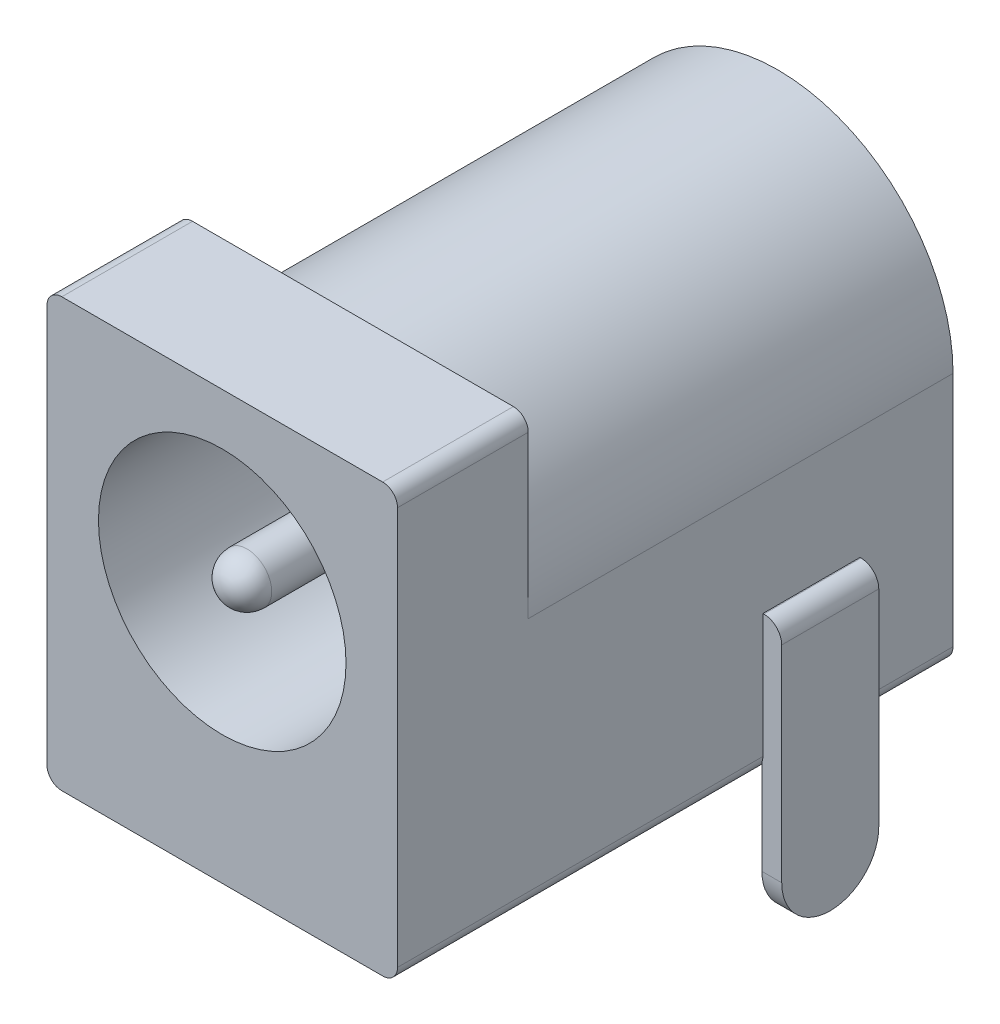
ISO-10303-21;
HEADER;
FILE_DESCRIPTION(('STEP AP214'),'2;1');
FILE_NAME('part.step','',(''),(''),'','','');
FILE_SCHEMA(('AUTOMOTIVE_DESIGN { 1 0 10303 214 1 1 1 1 }'));
ENDSEC;
DATA;
#1=APPLICATION_CONTEXT('core data for automotive mechanical design processes');
#2=APPLICATION_PROTOCOL_DEFINITION('international standard','automotive_design',2000,#1);
#3=PRODUCT_CONTEXT('',#1,'mechanical');
#4=PRODUCT('Part','Part','',(#3));
#5=PRODUCT_RELATED_PRODUCT_CATEGORY('part','',(#4));
#6=PRODUCT_DEFINITION_FORMATION('','',#4);
#7=PRODUCT_DEFINITION_CONTEXT('part definition',#1,'design');
#8=PRODUCT_DEFINITION('design','',#6,#7);
#9=PRODUCT_DEFINITION_SHAPE('','',#8);
#10=(LENGTH_UNIT() NAMED_UNIT(*) SI_UNIT(.MILLI.,.METRE.));
#11=(NAMED_UNIT(*) PLANE_ANGLE_UNIT() SI_UNIT($,.RADIAN.));
#12=(NAMED_UNIT(*) SI_UNIT($,.STERADIAN.) SOLID_ANGLE_UNIT());
#13=UNCERTAINTY_MEASURE_WITH_UNIT(LENGTH_MEASURE(1.E-05),#10,'distance_accuracy_value','');
#14=(GEOMETRIC_REPRESENTATION_CONTEXT(3) GLOBAL_UNCERTAINTY_ASSIGNED_CONTEXT((#13)) GLOBAL_UNIT_ASSIGNED_CONTEXT((#10,
#11,#12)) REPRESENTATION_CONTEXT('',''));
#15=CARTESIAN_POINT('',(0.,0.,0.));
#16=DIRECTION('',(0.,0.,1.));
#17=DIRECTION('',(1.,0.,0.));
#18=AXIS2_PLACEMENT_3D('',#15,#16,#17);
#19=CARTESIAN_POINT('',(8.9662,-3.683,2.3876));
#20=DIRECTION('',(-1.,0.,0.));
#21=DIRECTION('',(0.,0.,1.));
#22=AXIS2_PLACEMENT_3D('',#19,#20,#21);
#23=PLANE('',#22);
#24=DIRECTION('',(0.,1.,0.));
#25=VECTOR('',#24,1.);
#26=CARTESIAN_POINT('',(8.9662,-3.683,2.3876));
#27=LINE('',#26,#25);
#28=CARTESIAN_POINT('',(8.96619999999999,-2.1844,2.3876));
#29=VERTEX_POINT('',#28);
#30=CARTESIAN_POINT('',(8.9662,0.244216813898783,2.3876));
#31=VERTEX_POINT('',#30);
#32=EDGE_CURVE('E227',#29,#31,#27,.T.);
#33=ORIENTED_EDGE('',*,*,#32,.F.);
#34=CARTESIAN_POINT('',(8.96619999999999,-2.1844,3.6322));
#35=DIRECTION('',(1.,0.,0.));
#36=DIRECTION('',(0.,0.,-1.));
#37=AXIS2_PLACEMENT_3D('',#34,#35,#36);
#38=CIRCLE('',#37,1.2446);
#39=CARTESIAN_POINT('',(8.96619999999999,-2.1844,4.8768));
#40=VERTEX_POINT('',#39);
#41=EDGE_CURVE('E214',#40,#29,#38,.T.);
#42=ORIENTED_EDGE('',*,*,#41,.F.);
#43=DIRECTION('',(0.,1.,0.));
#44=VECTOR('',#43,1.);
#45=CARTESIAN_POINT('',(8.9662,-3.683,4.8768));
#46=LINE('',#45,#44);
#47=CARTESIAN_POINT('',(8.9662,0.244216813898783,4.8768));
#48=VERTEX_POINT('',#47);
#49=EDGE_CURVE('E247',#40,#48,#46,.T.);
#50=ORIENTED_EDGE('',*,*,#49,.T.);
#51=DIRECTION('',(0.,0.,-1.));
#52=VECTOR('',#51,1.);
#53=CARTESIAN_POINT('',(8.9662,0.244216813898783,14.2494));
#54=LINE('',#53,#52);
#55=EDGE_CURVE('E234',#31,#48,#54,.F.);
#56=ORIENTED_EDGE('',*,*,#55,.F.);
#57=EDGE_LOOP('',(#33,#42,#50,#56));
#58=FACE_BOUND('',#57,.T.);
#59=ADVANCED_FACE('F38',(#58),#23,.T.);
#60=CARTESIAN_POINT('',(8.9662,-3.683,2.3876));
#61=DIRECTION('',(0.,0.,1.));
#62=DIRECTION('',(1.,0.,0.));
#63=AXIS2_PLACEMENT_3D('',#60,#61,#62);
#64=PLANE('',#63);
#65=DIRECTION('',(1.,0.,0.));
#66=VECTOR('',#65,1.);
#67=CARTESIAN_POINT('',(8.96619999999999,-2.1844,2.3876));
#68=LINE('',#67,#66);
#69=CARTESIAN_POINT('',(9.47419999999999,-2.1844,2.3876));
#70=VERTEX_POINT('',#69);
#71=EDGE_CURVE('E53',#29,#70,#68,.T.);
#72=ORIENTED_EDGE('',*,*,#71,.F.);
#73=ORIENTED_EDGE('',*,*,#32,.T.);
#74=CARTESIAN_POINT('',(8.6106,0.380999999999999,2.3876));
#75=DIRECTION('',(0.,0.,1.));
#76=DIRECTION('',(1.,0.,0.));
#77=AXIS2_PLACEMENT_3D('',#74,#75,#76);
#78=CIRCLE('',#77,0.380999999999999);
#79=CARTESIAN_POINT('',(8.99159999999999,0.380999999999999,2.3876));
#80=VERTEX_POINT('',#79);
#81=EDGE_CURVE('E238',#31,#80,#78,.T.);
#82=ORIENTED_EDGE('',*,*,#81,.T.);
#83=DIRECTION('',(0.,-1.,0.));
#84=VECTOR('',#83,1.);
#85=CARTESIAN_POINT('',(8.9916,10.5918,2.3876));
#86=LINE('',#85,#84);
#87=CARTESIAN_POINT('',(8.9916,3.556,2.3876));
#88=VERTEX_POINT('',#87);
#89=EDGE_CURVE('E345',#88,#80,#86,.T.);
#90=ORIENTED_EDGE('',*,*,#89,.F.);
#91=DIRECTION('',(1.,0.,0.));
#92=VECTOR('',#91,1.);
#93=CARTESIAN_POINT('',(8.9662,3.556,2.3876));
#94=LINE('',#93,#92);
#95=CARTESIAN_POINT('',(9.017,3.556,2.3876));
#96=VERTEX_POINT('',#95);
#97=EDGE_CURVE('E243',#88,#96,#94,.T.);
#98=ORIENTED_EDGE('',*,*,#97,.T.);
#99=CARTESIAN_POINT('',(9.017,3.0988,2.3876));
#100=DIRECTION('',(0.,0.,1.));
#101=DIRECTION('',(1.,0.,0.));
#102=AXIS2_PLACEMENT_3D('',#99,#100,#101);
#103=CIRCLE('',#102,0.4572);
#104=CARTESIAN_POINT('',(9.47419999999999,3.0988,2.3876));
#105=VERTEX_POINT('',#104);
#106=EDGE_CURVE('E381',#96,#105,#103,.F.);
#107=ORIENTED_EDGE('',*,*,#106,.T.);
#108=DIRECTION('',(0.,1.,0.));
#109=VECTOR('',#108,1.);
#110=CARTESIAN_POINT('',(9.47419999999999,-3.683,2.3876));
#111=LINE('',#110,#109);
#112=EDGE_CURVE('E230',#70,#105,#111,.T.);
#113=ORIENTED_EDGE('',*,*,#112,.F.);
#114=EDGE_LOOP('',(#72,#73,#82,#90,#98,#107,#113));
#115=FACE_BOUND('',#114,.T.);
#116=ADVANCED_FACE('F225',(#115),#64,.F.);
#117=CARTESIAN_POINT('',(9.47419999999999,-3.683,4.8768));
#118=DIRECTION('',(1.,0.,0.));
#119=DIRECTION('',(0.,0.,-1.));
#120=AXIS2_PLACEMENT_3D('',#117,#118,#119);
#121=PLANE('',#120);
#122=DIRECTION('',(0.,1.,0.));
#123=VECTOR('',#122,1.);
#124=CARTESIAN_POINT('',(9.47419999999999,-3.683,4.8768));
#125=LINE('',#124,#123);
#126=CARTESIAN_POINT('',(9.47419999999999,-2.1844,4.8768));
#127=VERTEX_POINT('',#126);
#128=CARTESIAN_POINT('',(9.47419999999999,3.0988,4.8768));
#129=VERTEX_POINT('',#128);
#130=EDGE_CURVE('E240',#127,#129,#125,.T.);
#131=ORIENTED_EDGE('',*,*,#130,.F.);
#132=CARTESIAN_POINT('',(9.47419999999999,-2.1844,3.6322));
#133=DIRECTION('',(1.,0.,0.));
#134=DIRECTION('',(0.,0.,-1.));
#135=AXIS2_PLACEMENT_3D('',#132,#133,#134);
#136=CIRCLE('',#135,1.2446);
#137=EDGE_CURVE('E221',#127,#70,#136,.T.);
#138=ORIENTED_EDGE('',*,*,#137,.T.);
#139=ORIENTED_EDGE('',*,*,#112,.T.);
#140=DIRECTION('',(0.,0.,-1.));
#141=VECTOR('',#140,1.);
#142=CARTESIAN_POINT('',(9.47419999999999,3.0988,4.8768));
#143=LINE('',#142,#141);
#144=EDGE_CURVE('E383',#105,#129,#143,.F.);
#145=ORIENTED_EDGE('',*,*,#144,.T.);
#146=EDGE_LOOP('',(#131,#138,#139,#145));
#147=FACE_BOUND('',#146,.T.);
#148=ADVANCED_FACE('F442',(#147),#121,.T.);
#149=CARTESIAN_POINT('',(5.7404,-3.683,7.0104));
#150=DIRECTION('',(1.,0.,0.));
#151=DIRECTION('',(0.,0.,-1.));
#152=AXIS2_PLACEMENT_3D('',#149,#150,#151);
#153=PLANE('',#152);
#154=DIRECTION('',(0.,1.,0.));
#155=VECTOR('',#154,1.);
#156=CARTESIAN_POINT('',(5.7404,-3.683,7.0104));
#157=LINE('',#156,#155);
#158=CARTESIAN_POINT('',(5.7404,-2.1844,7.0104));
#159=VERTEX_POINT('',#158);
#160=CARTESIAN_POINT('',(5.7404,0.,7.0104));
#161=VERTEX_POINT('',#160);
#162=EDGE_CURVE('E472',#159,#161,#157,.T.);
#163=ORIENTED_EDGE('',*,*,#162,.F.);
#164=DIRECTION('',(0.,0.,-1.));
#165=VECTOR('',#164,1.);
#166=CARTESIAN_POINT('',(5.7404,-2.1844,7.26440000002886));
#167=LINE('',#166,#165);
#168=CARTESIAN_POINT('',(5.7404,-2.1844,6.75640000002886));
#169=VERTEX_POINT('',#168);
#170=EDGE_CURVE('E60',#159,#169,#167,.T.);
#171=ORIENTED_EDGE('',*,*,#170,.T.);
#172=DIRECTION('',(0.,1.,0.));
#173=VECTOR('',#172,1.);
#174=CARTESIAN_POINT('',(5.7404,-3.683,6.7564));
#175=LINE('',#174,#173);
#176=CARTESIAN_POINT('',(5.7404,0.,6.7564));
#177=VERTEX_POINT('',#176);
#178=EDGE_CURVE('E470',#169,#177,#175,.T.);
#179=ORIENTED_EDGE('',*,*,#178,.T.);
#180=DIRECTION('',(0.,0.,-1.));
#181=VECTOR('',#180,1.);
#182=CARTESIAN_POINT('',(5.74040000000005,0.,14.2494));
#183=LINE('',#182,#181);
#184=EDGE_CURVE('E372',#161,#177,#183,.T.);
#185=ORIENTED_EDGE('',*,*,#184,.F.);
#186=EDGE_LOOP('',(#163,#171,#179,#185));
#187=FACE_BOUND('',#186,.T.);
#188=ADVANCED_FACE('F604',(#187),#153,.T.);
#189=CARTESIAN_POINT('',(3.2512,-3.683,6.7564));
#190=DIRECTION('',(0.,0.,1.));
#191=DIRECTION('',(1.,0.,0.));
#192=AXIS2_PLACEMENT_3D('',#189,#190,#191);
#193=PLANE('',#192);
#194=CARTESIAN_POINT('',(4.4958,-2.1844,6.75640000002886));
#195=DIRECTION('',(0.,0.,-1.));
#196=DIRECTION('',(-1.,0.,0.));
#197=AXIS2_PLACEMENT_3D('',#194,#195,#196);
#198=CIRCLE('',#197,1.2446);
#199=CARTESIAN_POINT('',(3.2512,-2.1844,6.75640000002886));
#200=VERTEX_POINT('',#199);
#201=EDGE_CURVE('E439',#169,#200,#198,.T.);
#202=ORIENTED_EDGE('',*,*,#201,.T.);
#203=DIRECTION('',(0.,1.,0.));
#204=VECTOR('',#203,1.);
#205=CARTESIAN_POINT('',(3.2512,-3.683,6.7564));
#206=LINE('',#205,#204);
#207=CARTESIAN_POINT('',(3.2512,0.,6.7564));
#208=VERTEX_POINT('',#207);
#209=EDGE_CURVE('E467',#200,#208,#206,.T.);
#210=ORIENTED_EDGE('',*,*,#209,.T.);
#211=DIRECTION('',(1.,0.,0.));
#212=VECTOR('',#211,1.);
#213=CARTESIAN_POINT('',(0.381,0.,6.7564));
#214=LINE('',#213,#212);
#215=EDGE_CURVE('E477',#208,#177,#214,.T.);
#216=ORIENTED_EDGE('',*,*,#215,.T.);
#217=ORIENTED_EDGE('',*,*,#178,.F.);
#218=EDGE_LOOP('',(#202,#210,#216,#217));
#219=FACE_BOUND('',#218,.T.);
#220=ADVANCED_FACE('F593',(#219),#193,.F.);
#221=CARTESIAN_POINT('',(5.7404,-3.683,7.0104));
#222=DIRECTION('',(0.,0.,-1.));
#223=DIRECTION('',(-1.,0.,0.));
#224=AXIS2_PLACEMENT_3D('',#221,#222,#223);
#225=PLANE('',#224);
#226=CARTESIAN_POINT('',(4.4958,-2.1844,7.0104));
#227=DIRECTION('',(0.,0.,-1.));
#228=DIRECTION('',(-1.,0.,0.));
#229=AXIS2_PLACEMENT_3D('',#226,#227,#228);
#230=CIRCLE('',#229,1.2446);
#231=CARTESIAN_POINT('',(3.2512,-2.1844,7.0104));
#232=VERTEX_POINT('',#231);
#233=EDGE_CURVE('E12',#159,#232,#230,.T.);
#234=ORIENTED_EDGE('',*,*,#233,.F.);
#235=ORIENTED_EDGE('',*,*,#162,.T.);
#236=DIRECTION('',(-1.,0.,0.));
#237=VECTOR('',#236,1.);
#238=CARTESIAN_POINT('',(0.381,0.,7.0104));
#239=LINE('',#238,#237);
#240=CARTESIAN_POINT('',(3.2512,0.,7.0104));
#241=VERTEX_POINT('',#240);
#242=EDGE_CURVE('E469',#161,#241,#239,.T.);
#243=ORIENTED_EDGE('',*,*,#242,.T.);
#244=DIRECTION('',(0.,1.,0.));
#245=VECTOR('',#244,1.);
#246=CARTESIAN_POINT('',(3.2512,-3.683,7.0104));
#247=LINE('',#246,#245);
#248=EDGE_CURVE('E466',#232,#241,#247,.T.);
#249=ORIENTED_EDGE('',*,*,#248,.F.);
#250=EDGE_LOOP('',(#234,#235,#243,#249));
#251=FACE_BOUND('',#250,.T.);
#252=ADVANCED_FACE('F601',(#251),#225,.F.);
#253=CARTESIAN_POINT('',(2.9972,-3.683,0.381000000000002));
#254=DIRECTION('',(0.,0.,1.));
#255=DIRECTION('',(1.,0.,0.));
#256=AXIS2_PLACEMENT_3D('',#253,#254,#255);
#257=PLANE('',#256);
#258=CARTESIAN_POINT('',(4.4958,-1.9304,0.381000000000002));
#259=DIRECTION('',(0.,0.,-1.));
#260=DIRECTION('',(-1.,0.,0.));
#261=AXIS2_PLACEMENT_3D('',#258,#259,#260);
#262=CIRCLE('',#261,1.4986);
#263=CARTESIAN_POINT('',(5.9944,-1.9304,0.381000000000002));
#264=VERTEX_POINT('',#263);
#265=CARTESIAN_POINT('',(2.9972,-1.9304,0.381000000000002));
#266=VERTEX_POINT('',#265);
#267=EDGE_CURVE('E450',#264,#266,#262,.T.);
#268=ORIENTED_EDGE('',*,*,#267,.T.);
#269=DIRECTION('',(0.,1.,0.));
#270=VECTOR('',#269,1.);
#271=CARTESIAN_POINT('',(2.9972,-3.683,0.381000000000002));
#272=LINE('',#271,#270);
#273=CARTESIAN_POINT('',(2.9972,0.,0.381000000000002));
#274=VERTEX_POINT('',#273);
#275=EDGE_CURVE('E399',#266,#274,#272,.T.);
#276=ORIENTED_EDGE('',*,*,#275,.T.);
#277=DIRECTION('',(1.,0.,0.));
#278=VECTOR('',#277,1.);
#279=CARTESIAN_POINT('',(0.381,0.,0.381000000000002));
#280=LINE('',#279,#278);
#281=CARTESIAN_POINT('',(5.9944,0.,0.381000000000002));
#282=VERTEX_POINT('',#281);
#283=EDGE_CURVE('E354',#274,#282,#280,.T.);
#284=ORIENTED_EDGE('',*,*,#283,.T.);
#285=DIRECTION('',(0.,1.,0.));
#286=VECTOR('',#285,1.);
#287=CARTESIAN_POINT('',(5.9944,-3.683,0.381000000000002));
#288=LINE('',#287,#286);
#289=EDGE_CURVE('E482',#264,#282,#288,.T.);
#290=ORIENTED_EDGE('',*,*,#289,.F.);
#291=EDGE_LOOP('',(#268,#276,#284,#290));
#292=FACE_BOUND('',#291,.T.);
#293=ADVANCED_FACE('F506',(#292),#257,.F.);
#294=CARTESIAN_POINT('',(5.9944,-3.683,0.889000000000002));
#295=DIRECTION('',(1.,0.,0.));
#296=DIRECTION('',(0.,0.,-1.));
#297=AXIS2_PLACEMENT_3D('',#294,#295,#296);
#298=PLANE('',#297);
#299=DIRECTION('',(0.,1.,0.));
#300=VECTOR('',#299,1.);
#301=CARTESIAN_POINT('',(5.9944,-3.683,0.889000000000002));
#302=LINE('',#301,#300);
#303=CARTESIAN_POINT('',(5.9944,-1.9304,0.889000000000002));
#304=VERTEX_POINT('',#303);
#305=CARTESIAN_POINT('',(5.9944,0.,0.889000000000002));
#306=VERTEX_POINT('',#305);
#307=EDGE_CURVE('E484',#304,#306,#302,.T.);
#308=ORIENTED_EDGE('',*,*,#307,.F.);
#309=DIRECTION('',(0.,0.,-1.));
#310=VECTOR('',#309,1.);
#311=CARTESIAN_POINT('',(5.9944,-1.9304,0.889000000000003));
#312=LINE('',#311,#310);
#313=EDGE_CURVE('E453',#304,#264,#312,.T.);
#314=ORIENTED_EDGE('',*,*,#313,.T.);
#315=ORIENTED_EDGE('',*,*,#289,.T.);
#316=DIRECTION('',(0.,0.,-1.));
#317=VECTOR('',#316,1.);
#318=CARTESIAN_POINT('',(5.9944,0.,14.2494));
#319=LINE('',#318,#317);
#320=EDGE_CURVE('E351',#306,#282,#319,.T.);
#321=ORIENTED_EDGE('',*,*,#320,.F.);
#322=EDGE_LOOP('',(#308,#314,#315,#321));
#323=FACE_BOUND('',#322,.T.);
#324=ADVANCED_FACE('F503',(#323),#298,.T.);
#325=CARTESIAN_POINT('',(5.9944,-3.683,0.889000000000002));
#326=DIRECTION('',(0.,0.,-1.));
#327=DIRECTION('',(-1.,0.,0.));
#328=AXIS2_PLACEMENT_3D('',#325,#326,#327);
#329=PLANE('',#328);
#330=CARTESIAN_POINT('',(4.4958,-1.9304,0.889000000000003));
#331=DIRECTION('',(0.,0.,-1.));
#332=DIRECTION('',(-1.,0.,0.));
#333=AXIS2_PLACEMENT_3D('',#330,#331,#332);
#334=CIRCLE('',#333,1.4986);
#335=CARTESIAN_POINT('',(2.9972,-1.9304,0.889000000000003));
#336=VERTEX_POINT('',#335);
#337=EDGE_CURVE('E451',#304,#336,#334,.T.);
#338=ORIENTED_EDGE('',*,*,#337,.F.);
#339=ORIENTED_EDGE('',*,*,#307,.T.);
#340=DIRECTION('',(-1.,0.,0.));
#341=VECTOR('',#340,1.);
#342=CARTESIAN_POINT('',(0.380999999999999,0.,0.889000000000003));
#343=LINE('',#342,#341);
#344=CARTESIAN_POINT('',(2.9972,0.,0.889000000000003));
#345=VERTEX_POINT('',#344);
#346=EDGE_CURVE('E348',#306,#345,#343,.T.);
#347=ORIENTED_EDGE('',*,*,#346,.T.);
#348=DIRECTION('',(0.,1.,0.));
#349=VECTOR('',#348,1.);
#350=CARTESIAN_POINT('',(2.9972,-3.683,0.889000000000003));
#351=LINE('',#350,#349);
#352=EDGE_CURVE('E480',#336,#345,#351,.T.);
#353=ORIENTED_EDGE('',*,*,#352,.F.);
#354=EDGE_LOOP('',(#338,#339,#347,#353));
#355=FACE_BOUND('',#354,.T.);
#356=ADVANCED_FACE('F500',(#355),#329,.F.);
#357=CARTESIAN_POINT('',(4.4958,6.477,2.54));
#358=DIRECTION('',(0.,0.,1.));
#359=DIRECTION('',(1.,0.,0.));
#360=AXIS2_PLACEMENT_3D('',#357,#358,#359);
#361=CYLINDRICAL_SURFACE('',#360,3.175);
#362=CARTESIAN_POINT('',(4.4958,6.477,14.2494));
#363=DIRECTION('',(0.,0.,1.));
#364=DIRECTION('',(1.,0.,0.));
#365=AXIS2_PLACEMENT_3D('',#362,#363,#364);
#366=CIRCLE('',#365,3.175);
#367=CARTESIAN_POINT('',(7.6708,6.477,14.2494));
#368=VERTEX_POINT('',#367);
#369=EDGE_CURVE('E274',#368,#368,#366,.T.);
#370=ORIENTED_EDGE('',*,*,#369,.T.);
#371=EDGE_LOOP('',(#370));
#372=FACE_BOUND('',#371,.T.);
#373=CARTESIAN_POINT('',(4.4958,6.477,2.54));
#374=DIRECTION('',(0.,0.,1.));
#375=DIRECTION('',(1.,0.,0.));
#376=AXIS2_PLACEMENT_3D('',#373,#374,#375);
#377=CIRCLE('',#376,3.175);
#378=CARTESIAN_POINT('',(7.6708,6.477,2.54));
#379=VERTEX_POINT('',#378);
#380=EDGE_CURVE('E275',#379,#379,#377,.T.);
#381=ORIENTED_EDGE('',*,*,#380,.F.);
#382=EDGE_LOOP('',(#381));
#383=FACE_BOUND('',#382,.T.);
#384=DIRECTION('',(0.,0.,1.));
#385=VECTOR('',#384,1.);
#386=CARTESIAN_POINT('',(5.74014078933385,3.556,2.54));
#387=LINE('',#386,#385);
#388=CARTESIAN_POINT('',(5.74014078933385,3.556,7.0104));
#389=VERTEX_POINT('',#388);
#390=CARTESIAN_POINT('',(5.74014078933385,3.556,6.7564));
#391=VERTEX_POINT('',#390);
#392=EDGE_CURVE('E369',#389,#391,#387,.F.);
#393=ORIENTED_EDGE('',*,*,#392,.F.);
#394=CARTESIAN_POINT('',(4.4958,6.477,7.0104));
#395=DIRECTION('',(0.,0.,-1.));
#396=DIRECTION('',(-1.,0.,0.));
#397=AXIS2_PLACEMENT_3D('',#394,#395,#396);
#398=CIRCLE('',#397,3.175);
#399=CARTESIAN_POINT('',(3.25145921066615,3.556,7.0104));
#400=VERTEX_POINT('',#399);
#401=EDGE_CURVE('E363',#400,#389,#398,.F.);
#402=ORIENTED_EDGE('',*,*,#401,.F.);
#403=DIRECTION('',(0.,0.,1.));
#404=VECTOR('',#403,1.);
#405=CARTESIAN_POINT('',(3.25145921066615,3.556,2.54));
#406=LINE('',#405,#404);
#407=CARTESIAN_POINT('',(3.25145921066615,3.556,6.7564));
#408=VERTEX_POINT('',#407);
#409=EDGE_CURVE('E360',#408,#400,#406,.T.);
#410=ORIENTED_EDGE('',*,*,#409,.F.);
#411=CARTESIAN_POINT('',(4.4958,6.477,6.7564));
#412=DIRECTION('',(0.,0.,1.));
#413=DIRECTION('',(1.,0.,0.));
#414=AXIS2_PLACEMENT_3D('',#411,#412,#413);
#415=CIRCLE('',#414,3.175);
#416=EDGE_CURVE('E366',#391,#408,#415,.F.);
#417=ORIENTED_EDGE('',*,*,#416,.F.);
#418=EDGE_LOOP('',(#393,#402,#410,#417));
#419=FACE_BOUND('',#418,.T.);
#420=ADVANCED_FACE('F541',(#372,#383,#419),#361,.F.);
#421=CARTESIAN_POINT('',(8.6106,0.380999999999999,14.2494));
#422=DIRECTION('',(0.,0.,-1.));
#423=DIRECTION('',(-1.,0.,0.));
#424=AXIS2_PLACEMENT_3D('',#421,#422,#423);
#425=CYLINDRICAL_SURFACE('',#424,0.380999999999999);
#426=ORIENTED_EDGE('',*,*,#81,.F.);
#427=ORIENTED_EDGE('',*,*,#55,.T.);
#428=CARTESIAN_POINT('',(8.6106,0.380999999999999,4.8768));
#429=DIRECTION('',(0.,0.,-1.));
#430=DIRECTION('',(-1.,0.,0.));
#431=AXIS2_PLACEMENT_3D('',#428,#429,#430);
#432=CIRCLE('',#431,0.380999999999999);
#433=CARTESIAN_POINT('',(8.99159999999999,0.380999999999999,4.8768));
#434=VERTEX_POINT('',#433);
#435=EDGE_CURVE('E235',#434,#48,#432,.T.);
#436=ORIENTED_EDGE('',*,*,#435,.F.);
#437=DIRECTION('',(0.,0.,-1.));
#438=VECTOR('',#437,1.);
#439=CARTESIAN_POINT('',(8.99159999999999,0.380999999999999,14.2494));
#440=LINE('',#439,#438);
#441=CARTESIAN_POINT('',(8.99159999999999,0.380999999999999,14.2494));
#442=VERTEX_POINT('',#441);
#443=EDGE_CURVE('E323',#442,#434,#440,.T.);
#444=ORIENTED_EDGE('',*,*,#443,.F.);
#445=CARTESIAN_POINT('',(8.6106,0.380999999999999,14.2494));
#446=DIRECTION('',(0.,0.,1.));
#447=DIRECTION('',(1.,0.,0.));
#448=AXIS2_PLACEMENT_3D('',#445,#446,#447);
#449=CIRCLE('',#448,0.380999999999999);
#450=CARTESIAN_POINT('',(8.6106,0.,14.2494));
#451=VERTEX_POINT('',#450);
#452=EDGE_CURVE('E292',#451,#442,#449,.T.);
#453=ORIENTED_EDGE('',*,*,#452,.F.);
#454=DIRECTION('',(0.,0.,-1.));
#455=VECTOR('',#454,1.);
#456=CARTESIAN_POINT('',(8.6106,0.,14.2494));
#457=LINE('',#456,#455);
#458=CARTESIAN_POINT('',(8.6106,0.,0.));
#459=VERTEX_POINT('',#458);
#460=EDGE_CURVE('E326',#451,#459,#457,.T.);
#461=ORIENTED_EDGE('',*,*,#460,.T.);
#462=CARTESIAN_POINT('',(8.6106,0.380999999999999,0.));
#463=DIRECTION('',(0.,0.,1.));
#464=DIRECTION('',(1.,0.,0.));
#465=AXIS2_PLACEMENT_3D('',#462,#463,#464);
#466=CIRCLE('',#465,0.380999999999999);
#467=CARTESIAN_POINT('',(8.99159999999999,0.380999999999999,0.));
#468=VERTEX_POINT('',#467);
#469=EDGE_CURVE('E309',#459,#468,#466,.T.);
#470=ORIENTED_EDGE('',*,*,#469,.T.);
#471=EDGE_CURVE('E322',#80,#468,#440,.T.);
#472=ORIENTED_EDGE('',*,*,#471,.F.);
#473=EDGE_LOOP('',(#426,#427,#436,#444,#453,#461,#470,#472));
#474=FACE_BOUND('',#473,.T.);
#475=ADVANCED_FACE('F406',(#474),#425,.T.);
#476=CARTESIAN_POINT('',(8.9916,10.5918,14.2494));
#477=DIRECTION('',(1.,0.,0.));
#478=DIRECTION('',(0.,1.,0.));
#479=AXIS2_PLACEMENT_3D('',#476,#477,#478);
#480=PLANE('',#479);
#481=DIRECTION('',(0.,0.,1.));
#482=VECTOR('',#481,1.);
#483=CARTESIAN_POINT('',(8.9916,3.556,14.2494));
#484=LINE('',#483,#482);
#485=CARTESIAN_POINT('',(8.9916,3.556,4.8768));
#486=VERTEX_POINT('',#485);
#487=EDGE_CURVE('E339',#88,#486,#484,.T.);
#488=ORIENTED_EDGE('',*,*,#487,.F.);
#489=ORIENTED_EDGE('',*,*,#89,.T.);
#490=ORIENTED_EDGE('',*,*,#471,.T.);
#491=DIRECTION('',(0.,-1.,0.));
#492=VECTOR('',#491,1.);
#493=CARTESIAN_POINT('',(8.9916,10.5918,0.));
#494=LINE('',#493,#492);
#495=CARTESIAN_POINT('',(8.9916,6.4516,0.));
#496=VERTEX_POINT('',#495);
#497=EDGE_CURVE('E284',#496,#468,#494,.T.);
#498=ORIENTED_EDGE('',*,*,#497,.F.);
#499=DIRECTION('',(0.,0.,-1.));
#500=VECTOR('',#499,1.);
#501=CARTESIAN_POINT('',(8.9916,6.4516,24.3136992801287));
#502=LINE('',#501,#500);
#503=CARTESIAN_POINT('',(8.9916,6.4516,10.8966));
#504=VERTEX_POINT('',#503);
#505=EDGE_CURVE('E263',#504,#496,#502,.T.);
#506=ORIENTED_EDGE('',*,*,#505,.F.);
#507=DIRECTION('',(0.,-1.,0.));
#508=VECTOR('',#507,1.);
#509=CARTESIAN_POINT('',(8.9916,10.5918,10.8966));
#510=LINE('',#509,#508);
#511=CARTESIAN_POINT('',(8.9916,10.5918,10.8966));
#512=VERTEX_POINT('',#511);
#513=EDGE_CURVE('E260',#512,#504,#510,.T.);
#514=ORIENTED_EDGE('',*,*,#513,.F.);
#515=DIRECTION('',(0.,0.,-1.));
#516=VECTOR('',#515,1.);
#517=CARTESIAN_POINT('',(8.9916,10.5918,14.2494));
#518=LINE('',#517,#516);
#519=CARTESIAN_POINT('',(8.9916,10.5918,14.2494));
#520=VERTEX_POINT('',#519);
#521=EDGE_CURVE('E319',#520,#512,#518,.T.);
#522=ORIENTED_EDGE('',*,*,#521,.F.);
#523=DIRECTION('',(0.,-1.,0.));
#524=VECTOR('',#523,1.);
#525=CARTESIAN_POINT('',(8.9916,10.5918,14.2494));
#526=LINE('',#525,#524);
#527=EDGE_CURVE('E294',#520,#442,#526,.T.);
#528=ORIENTED_EDGE('',*,*,#527,.T.);
#529=ORIENTED_EDGE('',*,*,#443,.T.);
#530=DIRECTION('',(0.,1.,0.));
#531=VECTOR('',#530,1.);
#532=CARTESIAN_POINT('',(8.9916,10.5918,4.8768));
#533=LINE('',#532,#531);
#534=EDGE_CURVE('E342',#434,#486,#533,.T.);
#535=ORIENTED_EDGE('',*,*,#534,.T.);
#536=EDGE_LOOP('',(#488,#489,#490,#498,#506,#514,#522,#528,#529,#535));
#537=FACE_BOUND('',#536,.T.);
#538=ADVANCED_FACE('F403',(#537),#480,.T.);
#539=CARTESIAN_POINT('',(0.381,10.5918,0.));
#540=DIRECTION('',(0.,0.,1.));
#541=DIRECTION('',(1.,0.,0.));
#542=AXIS2_PLACEMENT_3D('',#539,#540,#541);
#543=PLANE('',#542);
#544=CARTESIAN_POINT('',(4.4958,6.4516,0.));
#545=DIRECTION('',(0.,0.,-1.));
#546=DIRECTION('',(-1.,0.,0.));
#547=AXIS2_PLACEMENT_3D('',#544,#545,#546);
#548=CIRCLE('',#547,4.4958);
#549=CARTESIAN_POINT('',(0.,6.4516,0.));
#550=VERTEX_POINT('',#549);
#551=EDGE_CURVE('E251',#550,#496,#548,.T.);
#552=ORIENTED_EDGE('',*,*,#551,.T.);
#553=ORIENTED_EDGE('',*,*,#497,.T.);
#554=ORIENTED_EDGE('',*,*,#469,.F.);
#555=DIRECTION('',(1.,0.,0.));
#556=VECTOR('',#555,1.);
#557=CARTESIAN_POINT('',(0.381,0.,0.));
#558=LINE('',#557,#556);
#559=CARTESIAN_POINT('',(0.381,0.,0.));
#560=VERTEX_POINT('',#559);
#561=EDGE_CURVE('E307',#560,#459,#558,.T.);
#562=ORIENTED_EDGE('',*,*,#561,.F.);
#563=CARTESIAN_POINT('',(0.381,0.381,0.));
#564=DIRECTION('',(0.,0.,-1.));
#565=DIRECTION('',(-1.,0.,0.));
#566=AXIS2_PLACEMENT_3D('',#563,#564,#565);
#567=CIRCLE('',#566,0.381);
#568=CARTESIAN_POINT('',(0.,0.381,0.));
#569=VERTEX_POINT('',#568);
#570=EDGE_CURVE('E304',#560,#569,#567,.T.);
#571=ORIENTED_EDGE('',*,*,#570,.T.);
#572=DIRECTION('',(0.,1.,0.));
#573=VECTOR('',#572,1.);
#574=CARTESIAN_POINT('',(0.,0.381,0.));
#575=LINE('',#574,#573);
#576=EDGE_CURVE('E278',#569,#550,#575,.T.);
#577=ORIENTED_EDGE('',*,*,#576,.T.);
#578=EDGE_LOOP('',(#552,#553,#554,#562,#571,#577));
#579=FACE_BOUND('',#578,.T.);
#580=ADVANCED_FACE('F412',(#579),#543,.F.);
#581=CARTESIAN_POINT('',(0.381,10.5918,14.2494));
#582=DIRECTION('',(0.,0.,-1.));
#583=DIRECTION('',(-1.,0.,0.));
#584=AXIS2_PLACEMENT_3D('',#581,#582,#583);
#585=CYLINDRICAL_SURFACE('',#584,0.381);
#586=DIRECTION('',(0.,0.,-1.));
#587=VECTOR('',#586,1.);
#588=CARTESIAN_POINT('',(0.381,10.9728,14.2494));
#589=LINE('',#588,#587);
#590=CARTESIAN_POINT('',(0.381,10.9728,14.2494));
#591=VERTEX_POINT('',#590);
#592=CARTESIAN_POINT('',(0.381,10.9728,10.8966));
#593=VERTEX_POINT('',#592);
#594=EDGE_CURVE('E301',#591,#593,#589,.T.);
#595=ORIENTED_EDGE('',*,*,#594,.T.);
#596=CARTESIAN_POINT('',(0.381,10.5918,10.8966));
#597=DIRECTION('',(0.,0.,1.));
#598=DIRECTION('',(1.,0.,0.));
#599=AXIS2_PLACEMENT_3D('',#596,#597,#598);
#600=CIRCLE('',#599,0.381);
#601=CARTESIAN_POINT('',(0.,10.5918,10.8966));
#602=VERTEX_POINT('',#601);
#603=EDGE_CURVE('E258',#602,#593,#600,.F.);
#604=ORIENTED_EDGE('',*,*,#603,.F.);
#605=DIRECTION('',(0.,0.,-1.));
#606=VECTOR('',#605,1.);
#607=CARTESIAN_POINT('',(0.,10.5918,14.2494));
#608=LINE('',#607,#606);
#609=CARTESIAN_POINT('',(0.,10.5918,14.2494));
#610=VERTEX_POINT('',#609);
#611=EDGE_CURVE('E333',#610,#602,#608,.T.);
#612=ORIENTED_EDGE('',*,*,#611,.F.);
#613=CARTESIAN_POINT('',(0.381,10.5918,14.2494));
#614=DIRECTION('',(0.,0.,1.));
#615=DIRECTION('',(1.,0.,0.));
#616=AXIS2_PLACEMENT_3D('',#613,#614,#615);
#617=CIRCLE('',#616,0.381);
#618=EDGE_CURVE('E281',#591,#610,#617,.T.);
#619=ORIENTED_EDGE('',*,*,#618,.F.);
#620=EDGE_LOOP('',(#595,#604,#612,#619));
#621=FACE_BOUND('',#620,.T.);
#622=ADVANCED_FACE('F550',(#621),#585,.T.);
#623=CARTESIAN_POINT('',(0.,0.381,14.2494));
#624=DIRECTION('',(-1.,0.,0.));
#625=DIRECTION('',(0.,-1.,0.));
#626=AXIS2_PLACEMENT_3D('',#623,#624,#625);
#627=PLANE('',#626);
#628=DIRECTION('',(0.,1.,0.));
#629=VECTOR('',#628,1.);
#630=CARTESIAN_POINT('',(0.,6.4516,10.8966));
#631=LINE('',#630,#629);
#632=CARTESIAN_POINT('',(0.,6.4516,10.8966));
#633=VERTEX_POINT('',#632);
#634=EDGE_CURVE('E256',#633,#602,#631,.T.);
#635=ORIENTED_EDGE('',*,*,#634,.F.);
#636=DIRECTION('',(0.,0.,-1.));
#637=VECTOR('',#636,1.);
#638=CARTESIAN_POINT('',(0.,6.4516,24.3136992801287));
#639=LINE('',#638,#637);
#640=EDGE_CURVE('E255',#633,#550,#639,.T.);
#641=ORIENTED_EDGE('',*,*,#640,.T.);
#642=ORIENTED_EDGE('',*,*,#576,.F.);
#643=DIRECTION('',(0.,0.,-1.));
#644=VECTOR('',#643,1.);
#645=CARTESIAN_POINT('',(0.,0.381,14.2494));
#646=LINE('',#645,#644);
#647=CARTESIAN_POINT('',(0.,0.381,14.2494));
#648=VERTEX_POINT('',#647);
#649=EDGE_CURVE('E331',#648,#569,#646,.T.);
#650=ORIENTED_EDGE('',*,*,#649,.F.);
#651=DIRECTION('',(0.,1.,0.));
#652=VECTOR('',#651,1.);
#653=CARTESIAN_POINT('',(0.,0.381,14.2494));
#654=LINE('',#653,#652);
#655=EDGE_CURVE('E283',#648,#610,#654,.T.);
#656=ORIENTED_EDGE('',*,*,#655,.T.);
#657=ORIENTED_EDGE('',*,*,#611,.T.);
#658=EDGE_LOOP('',(#635,#641,#642,#650,#656,#657));
#659=FACE_BOUND('',#658,.T.);
#660=ADVANCED_FACE('F565',(#659),#627,.T.);
#661=CARTESIAN_POINT('',(0.381,0.381,14.2494));
#662=DIRECTION('',(0.,0.,-1.));
#663=DIRECTION('',(-1.,0.,0.));
#664=AXIS2_PLACEMENT_3D('',#661,#662,#663);
#665=CYLINDRICAL_SURFACE('',#664,0.381);
#666=ORIENTED_EDGE('',*,*,#570,.F.);
#667=DIRECTION('',(0.,0.,-1.));
#668=VECTOR('',#667,1.);
#669=CARTESIAN_POINT('',(0.381,0.,14.2494));
#670=LINE('',#669,#668);
#671=CARTESIAN_POINT('',(0.381,0.,14.2494));
#672=VERTEX_POINT('',#671);
#673=EDGE_CURVE('E329',#672,#560,#670,.T.);
#674=ORIENTED_EDGE('',*,*,#673,.F.);
#675=CARTESIAN_POINT('',(0.381,0.381,14.2494));
#676=DIRECTION('',(0.,0.,-1.));
#677=DIRECTION('',(-1.,0.,0.));
#678=AXIS2_PLACEMENT_3D('',#675,#676,#677);
#679=CIRCLE('',#678,0.381);
#680=EDGE_CURVE('E287',#672,#648,#679,.T.);
#681=ORIENTED_EDGE('',*,*,#680,.T.);
#682=ORIENTED_EDGE('',*,*,#649,.T.);
#683=EDGE_LOOP('',(#666,#674,#681,#682));
#684=FACE_BOUND('',#683,.T.);
#685=ADVANCED_FACE('F561',(#684),#665,.T.);
#686=CARTESIAN_POINT('',(0.381,0.,14.2494));
#687=DIRECTION('',(0.,1.,0.));
#688=DIRECTION('',(0.,0.,1.));
#689=AXIS2_PLACEMENT_3D('',#686,#687,#688);
#690=PLANE('',#689);
#691=ORIENTED_EDGE('',*,*,#215,.F.);
#692=DIRECTION('',(0.,0.,1.));
#693=VECTOR('',#692,1.);
#694=CARTESIAN_POINT('',(3.25120000000001,0.,14.2494));
#695=LINE('',#694,#693);
#696=EDGE_CURVE('E375',#208,#241,#695,.T.);
#697=ORIENTED_EDGE('',*,*,#696,.T.);
#698=ORIENTED_EDGE('',*,*,#242,.F.);
#699=ORIENTED_EDGE('',*,*,#184,.T.);
#700=EDGE_LOOP('',(#691,#697,#698,#699));
#701=FACE_BOUND('',#700,.T.);
#702=ORIENTED_EDGE('',*,*,#283,.F.);
#703=DIRECTION('',(0.,0.,1.));
#704=VECTOR('',#703,1.);
#705=CARTESIAN_POINT('',(2.9972,0.,14.2494));
#706=LINE('',#705,#704);
#707=EDGE_CURVE('E357',#274,#345,#706,.T.);
#708=ORIENTED_EDGE('',*,*,#707,.T.);
#709=ORIENTED_EDGE('',*,*,#346,.F.);
#710=ORIENTED_EDGE('',*,*,#320,.T.);
#711=EDGE_LOOP('',(#702,#708,#709,#710));
#712=FACE_BOUND('',#711,.T.);
#713=ORIENTED_EDGE('',*,*,#561,.T.);
#714=ORIENTED_EDGE('',*,*,#460,.F.);
#715=DIRECTION('',(1.,0.,0.));
#716=VECTOR('',#715,1.);
#717=CARTESIAN_POINT('',(0.381,0.,14.2494));
#718=LINE('',#717,#716);
#719=EDGE_CURVE('E290',#672,#451,#718,.T.);
#720=ORIENTED_EDGE('',*,*,#719,.F.);
#721=ORIENTED_EDGE('',*,*,#673,.T.);
#722=EDGE_LOOP('',(#713,#714,#720,#721));
#723=FACE_BOUND('',#722,.T.);
#724=ADVANCED_FACE('F497',(#701,#712,#723),#690,.F.);
#725=CARTESIAN_POINT('',(8.6106,10.5918,14.2494));
#726=DIRECTION('',(0.,0.,-1.));
#727=DIRECTION('',(-1.,0.,0.));
#728=AXIS2_PLACEMENT_3D('',#725,#726,#727);
#729=CYLINDRICAL_SURFACE('',#728,0.380999999999999);
#730=ORIENTED_EDGE('',*,*,#521,.T.);
#731=CARTESIAN_POINT('',(8.6106,10.5918,10.8966));
#732=DIRECTION('',(0.,0.,1.));
#733=DIRECTION('',(1.,0.,0.));
#734=AXIS2_PLACEMENT_3D('',#731,#732,#733);
#735=CIRCLE('',#734,0.380999999999999);
#736=CARTESIAN_POINT('',(8.6106,10.9728,10.8966));
#737=VERTEX_POINT('',#736);
#738=EDGE_CURVE('E264',#737,#512,#735,.F.);
#739=ORIENTED_EDGE('',*,*,#738,.F.);
#740=DIRECTION('',(0.,0.,-1.));
#741=VECTOR('',#740,1.);
#742=CARTESIAN_POINT('',(8.6106,10.9728,14.2494));
#743=LINE('',#742,#741);
#744=CARTESIAN_POINT('',(8.6106,10.9728,14.2494));
#745=VERTEX_POINT('',#744);
#746=EDGE_CURVE('E316',#745,#737,#743,.T.);
#747=ORIENTED_EDGE('',*,*,#746,.F.);
#748=CARTESIAN_POINT('',(8.6106,10.5918,14.2494));
#749=DIRECTION('',(0.,0.,1.));
#750=DIRECTION('',(1.,0.,0.));
#751=AXIS2_PLACEMENT_3D('',#748,#749,#750);
#752=CIRCLE('',#751,0.380999999999999);
#753=EDGE_CURVE('E297',#520,#745,#752,.T.);
#754=ORIENTED_EDGE('',*,*,#753,.F.);
#755=EDGE_LOOP('',(#730,#739,#747,#754));
#756=FACE_BOUND('',#755,.T.);
#757=ADVANCED_FACE('F426',(#756),#729,.T.);
#758=CARTESIAN_POINT('',(8.6106,10.9728,14.2494));
#759=DIRECTION('',(0.,-1.,0.));
#760=DIRECTION('',(1.,0.,0.));
#761=AXIS2_PLACEMENT_3D('',#758,#759,#760);
#762=PLANE('',#761);
#763=ORIENTED_EDGE('',*,*,#746,.T.);
#764=DIRECTION('',(1.,0.,0.));
#765=VECTOR('',#764,1.);
#766=CARTESIAN_POINT('',(0.381,10.9728,10.8966));
#767=LINE('',#766,#765);
#768=EDGE_CURVE('E266',#593,#737,#767,.T.);
#769=ORIENTED_EDGE('',*,*,#768,.F.);
#770=ORIENTED_EDGE('',*,*,#594,.F.);
#771=DIRECTION('',(-1.,0.,0.));
#772=VECTOR('',#771,1.);
#773=CARTESIAN_POINT('',(8.6106,10.9728,14.2494));
#774=LINE('',#773,#772);
#775=EDGE_CURVE('E299',#745,#591,#774,.T.);
#776=ORIENTED_EDGE('',*,*,#775,.F.);
#777=EDGE_LOOP('',(#763,#769,#770,#776));
#778=FACE_BOUND('',#777,.T.);
#779=ADVANCED_FACE('F430',(#778),#762,.F.);
#780=CARTESIAN_POINT('',(0.381,10.5918,14.2494));
#781=DIRECTION('',(0.,0.,1.));
#782=DIRECTION('',(1.,0.,0.));
#783=AXIS2_PLACEMENT_3D('',#780,#781,#782);
#784=PLANE('',#783);
#785=ORIENTED_EDGE('',*,*,#369,.F.);
#786=EDGE_LOOP('',(#785));
#787=FACE_BOUND('',#786,.T.);
#788=ORIENTED_EDGE('',*,*,#618,.T.);
#789=ORIENTED_EDGE('',*,*,#655,.F.);
#790=ORIENTED_EDGE('',*,*,#680,.F.);
#791=ORIENTED_EDGE('',*,*,#719,.T.);
#792=ORIENTED_EDGE('',*,*,#452,.T.);
#793=ORIENTED_EDGE('',*,*,#527,.F.);
#794=ORIENTED_EDGE('',*,*,#753,.T.);
#795=ORIENTED_EDGE('',*,*,#775,.T.);
#796=EDGE_LOOP('',(#788,#789,#790,#791,#792,#793,#794,#795));
#797=FACE_BOUND('',#796,.T.);
#798=ADVANCED_FACE('F434',(#787,#797),#784,.T.);
#799=CARTESIAN_POINT('',(4.4958,6.477,2.54));
#800=DIRECTION('',(0.,0.,1.));
#801=DIRECTION('',(1.,0.,0.));
#802=AXIS2_PLACEMENT_3D('',#799,#800,#801);
#803=PLANE('',#802);
#804=CARTESIAN_POINT('',(4.4958,6.477,2.54));
#805=DIRECTION('',(0.,0.,1.));
#806=DIRECTION('',(1.,0.,0.));
#807=AXIS2_PLACEMENT_3D('',#804,#805,#806);
#808=CIRCLE('',#807,0.635000000000001);
#809=CARTESIAN_POINT('',(5.1308,6.477,2.54));
#810=VERTEX_POINT('',#809);
#811=EDGE_CURVE('E254',#810,#810,#808,.T.);
#812=ORIENTED_EDGE('',*,*,#811,.F.);
#813=EDGE_LOOP('',(#812));
#814=FACE_BOUND('',#813,.T.);
#815=ORIENTED_EDGE('',*,*,#380,.T.);
#816=EDGE_LOOP('',(#815));
#817=FACE_BOUND('',#816,.T.);
#818=ADVANCED_FACE('F536',(#814,#817),#803,.T.);
#819=CARTESIAN_POINT('',(4.4958,6.477,2.54));
#820=DIRECTION('',(0.,0.,1.));
#821=DIRECTION('',(1.,0.,0.));
#822=AXIS2_PLACEMENT_3D('',#819,#820,#821);
#823=CYLINDRICAL_SURFACE('',#822,0.635000000000001);
#824=CARTESIAN_POINT('',(4.4958,6.477,13.6144));
#825=DIRECTION('',(0.,0.,1.));
#826=DIRECTION('',(1.,0.,0.));
#827=AXIS2_PLACEMENT_3D('',#824,#825,#826);
#828=CIRCLE('',#827,0.635000000000001);
#829=CARTESIAN_POINT('',(5.1308,6.477,13.6144));
#830=VERTEX_POINT('',#829);
#831=EDGE_CURVE('E336',#830,#830,#828,.F.);
#832=ORIENTED_EDGE('',*,*,#831,.T.);
#833=EDGE_LOOP('',(#832));
#834=FACE_BOUND('',#833,.T.);
#835=ORIENTED_EDGE('',*,*,#811,.T.);
#836=EDGE_LOOP('',(#835));
#837=FACE_BOUND('',#836,.T.);
#838=ADVANCED_FACE('F533',(#834,#837),#823,.T.);
#839=CARTESIAN_POINT('',(4.4958,6.477,13.6144));
#840=DIRECTION('',(0.,0.,1.));
#841=DIRECTION('',(1.,0.,0.));
#842=AXIS2_PLACEMENT_3D('',#839,#840,#841);
#843=SPHERICAL_SURFACE('',#842,0.635);
#844=ORIENTED_EDGE('',*,*,#831,.F.);
#845=EDGE_LOOP('',(#844));
#846=FACE_BOUND('',#845,.T.);
#847=ADVANCED_FACE('F532',(#846),#843,.T.);
#848=CARTESIAN_POINT('',(0.381,10.5918,10.8966));
#849=DIRECTION('',(0.,0.,1.));
#850=DIRECTION('',(1.,0.,0.));
#851=AXIS2_PLACEMENT_3D('',#848,#849,#850);
#852=PLANE('',#851);
#853=ORIENTED_EDGE('',*,*,#634,.T.);
#854=ORIENTED_EDGE('',*,*,#603,.T.);
#855=ORIENTED_EDGE('',*,*,#768,.T.);
#856=ORIENTED_EDGE('',*,*,#738,.T.);
#857=ORIENTED_EDGE('',*,*,#513,.T.);
#858=CARTESIAN_POINT('',(4.4958,6.4516,10.8966));
#859=DIRECTION('',(0.,0.,1.));
#860=DIRECTION('',(1.,0.,0.));
#861=AXIS2_PLACEMENT_3D('',#858,#859,#860);
#862=CIRCLE('',#861,4.4958);
#863=EDGE_CURVE('E250',#633,#504,#862,.F.);
#864=ORIENTED_EDGE('',*,*,#863,.F.);
#865=EDGE_LOOP('',(#853,#854,#855,#856,#857,#864));
#866=FACE_BOUND('',#865,.T.);
#867=ADVANCED_FACE('F421',(#866),#852,.F.);
#868=CARTESIAN_POINT('',(4.4958,6.4516,24.3136992801287));
#869=DIRECTION('',(0.,0.,-1.));
#870=DIRECTION('',(-1.,0.,0.));
#871=AXIS2_PLACEMENT_3D('',#868,#869,#870);
#872=CYLINDRICAL_SURFACE('',#871,4.4958);
#873=ORIENTED_EDGE('',*,*,#863,.T.);
#874=ORIENTED_EDGE('',*,*,#505,.T.);
#875=ORIENTED_EDGE('',*,*,#551,.F.);
#876=ORIENTED_EDGE('',*,*,#640,.F.);
#877=EDGE_LOOP('',(#873,#874,#875,#876));
#878=FACE_BOUND('',#877,.T.);
#879=ADVANCED_FACE('F417',(#878),#872,.T.);
#880=CARTESIAN_POINT('',(9.47419999999999,-3.683,4.8768));
#881=DIRECTION('',(0.,0.,-1.));
#882=DIRECTION('',(-1.,0.,0.));
#883=AXIS2_PLACEMENT_3D('',#880,#881,#882);
#884=PLANE('',#883);
#885=ORIENTED_EDGE('',*,*,#49,.F.);
#886=DIRECTION('',(1.,0.,0.));
#887=VECTOR('',#886,1.);
#888=CARTESIAN_POINT('',(8.96619999999999,-2.1844,4.8768));
#889=LINE('',#888,#887);
#890=EDGE_CURVE('E217',#40,#127,#889,.T.);
#891=ORIENTED_EDGE('',*,*,#890,.T.);
#892=ORIENTED_EDGE('',*,*,#130,.T.);
#893=CARTESIAN_POINT('',(9.017,3.0988,4.8768));
#894=DIRECTION('',(0.,0.,-1.));
#895=DIRECTION('',(-1.,0.,0.));
#896=AXIS2_PLACEMENT_3D('',#893,#894,#895);
#897=CIRCLE('',#896,0.4572);
#898=CARTESIAN_POINT('',(9.017,3.556,4.8768));
#899=VERTEX_POINT('',#898);
#900=EDGE_CURVE('E46',#129,#899,#897,.F.);
#901=ORIENTED_EDGE('',*,*,#900,.T.);
#902=DIRECTION('',(-1.,0.,0.));
#903=VECTOR('',#902,1.);
#904=CARTESIAN_POINT('',(9.47419999999999,3.556,4.8768));
#905=LINE('',#904,#903);
#906=EDGE_CURVE('E390',#899,#486,#905,.T.);
#907=ORIENTED_EDGE('',*,*,#906,.T.);
#908=ORIENTED_EDGE('',*,*,#534,.F.);
#909=ORIENTED_EDGE('',*,*,#435,.T.);
#910=EDGE_LOOP('',(#885,#891,#892,#901,#907,#908,#909));
#911=FACE_BOUND('',#910,.T.);
#912=ADVANCED_FACE('F388',(#911),#884,.F.);
#913=CARTESIAN_POINT('',(8.9662,3.556,2.3876));
#914=DIRECTION('',(0.,1.,0.));
#915=DIRECTION('',(0.,0.,1.));
#916=AXIS2_PLACEMENT_3D('',#913,#914,#915);
#917=PLANE('',#916);
#918=ORIENTED_EDGE('',*,*,#906,.F.);
#919=DIRECTION('',(0.,0.,-1.));
#920=VECTOR('',#919,1.);
#921=CARTESIAN_POINT('',(9.017,3.556,2.3876));
#922=LINE('',#921,#920);
#923=EDGE_CURVE('E378',#899,#96,#922,.T.);
#924=ORIENTED_EDGE('',*,*,#923,.T.);
#925=ORIENTED_EDGE('',*,*,#97,.F.);
#926=ORIENTED_EDGE('',*,*,#487,.T.);
#927=EDGE_LOOP('',(#918,#924,#925,#926));
#928=FACE_BOUND('',#927,.T.);
#929=ADVANCED_FACE('F396',(#928),#917,.T.);
#930=CARTESIAN_POINT('',(2.9972,-3.683,0.381000000000002));
#931=DIRECTION('',(-1.,0.,0.));
#932=DIRECTION('',(0.,0.,1.));
#933=AXIS2_PLACEMENT_3D('',#930,#931,#932);
#934=PLANE('',#933);
#935=DIRECTION('',(0.,0.,-1.));
#936=VECTOR('',#935,1.);
#937=CARTESIAN_POINT('',(2.9972,-1.9304,0.889000000000003));
#938=LINE('',#937,#936);
#939=EDGE_CURVE('E458',#336,#266,#938,.T.);
#940=ORIENTED_EDGE('',*,*,#939,.F.);
#941=ORIENTED_EDGE('',*,*,#352,.T.);
#942=ORIENTED_EDGE('',*,*,#707,.F.);
#943=ORIENTED_EDGE('',*,*,#275,.F.);
#944=EDGE_LOOP('',(#940,#941,#942,#943));
#945=FACE_BOUND('',#944,.T.);
#946=ADVANCED_FACE('F490',(#945),#934,.T.);
#947=CARTESIAN_POINT('',(3.2512,3.556,7.0104));
#948=DIRECTION('',(0.,-1.,0.));
#949=DIRECTION('',(0.,0.,-1.));
#950=AXIS2_PLACEMENT_3D('',#947,#948,#949);
#951=PLANE('',#950);
#952=DIRECTION('',(-1.,0.,0.));
#953=VECTOR('',#952,1.);
#954=CARTESIAN_POINT('',(5.7404,3.556,7.0104));
#955=LINE('',#954,#953);
#956=EDGE_CURVE('E460',#389,#400,#955,.T.);
#957=ORIENTED_EDGE('',*,*,#956,.F.);
#958=ORIENTED_EDGE('',*,*,#392,.T.);
#959=DIRECTION('',(1.,0.,0.));
#960=VECTOR('',#959,1.);
#961=CARTESIAN_POINT('',(3.2512,3.556,6.7564));
#962=LINE('',#961,#960);
#963=EDGE_CURVE('E463',#408,#391,#962,.T.);
#964=ORIENTED_EDGE('',*,*,#963,.F.);
#965=ORIENTED_EDGE('',*,*,#409,.T.);
#966=EDGE_LOOP('',(#957,#958,#964,#965));
#967=FACE_BOUND('',#966,.T.);
#968=ADVANCED_FACE('F588',(#967),#951,.F.);
#969=ORIENTED_EDGE('',*,*,#956,.T.);
#970=ORIENTED_EDGE('',*,*,#401,.T.);
#971=EDGE_LOOP('',(#969,#970));
#972=FACE_BOUND('',#971,.T.);
#973=ADVANCED_FACE('F587',(#972),#225,.F.);
#974=ORIENTED_EDGE('',*,*,#963,.T.);
#975=ORIENTED_EDGE('',*,*,#416,.T.);
#976=EDGE_LOOP('',(#974,#975));
#977=FACE_BOUND('',#976,.T.);
#978=ADVANCED_FACE('F590',(#977),#193,.F.);
#979=CARTESIAN_POINT('',(3.2512,-3.683,6.7564));
#980=DIRECTION('',(-1.,0.,0.));
#981=DIRECTION('',(0.,0.,1.));
#982=AXIS2_PLACEMENT_3D('',#979,#980,#981);
#983=PLANE('',#982);
#984=DIRECTION('',(0.,0.,-1.));
#985=VECTOR('',#984,1.);
#986=CARTESIAN_POINT('',(3.2512,-2.1844,7.26440000002886));
#987=LINE('',#986,#985);
#988=EDGE_CURVE('E448',#232,#200,#987,.T.);
#989=ORIENTED_EDGE('',*,*,#988,.F.);
#990=ORIENTED_EDGE('',*,*,#248,.T.);
#991=ORIENTED_EDGE('',*,*,#696,.F.);
#992=ORIENTED_EDGE('',*,*,#209,.F.);
#993=EDGE_LOOP('',(#989,#990,#991,#992));
#994=FACE_BOUND('',#993,.T.);
#995=ADVANCED_FACE('F517',(#994),#983,.T.);
#996=CARTESIAN_POINT('',(9.017,3.0988,2.3876));
#997=DIRECTION('',(0.,0.,-1.));
#998=DIRECTION('',(-1.,0.,0.));
#999=AXIS2_PLACEMENT_3D('',#996,#997,#998);
#1000=CYLINDRICAL_SURFACE('',#999,0.4572);
#1001=ORIENTED_EDGE('',*,*,#900,.F.);
#1002=ORIENTED_EDGE('',*,*,#144,.F.);
#1003=ORIENTED_EDGE('',*,*,#106,.F.);
#1004=ORIENTED_EDGE('',*,*,#923,.F.);
#1005=EDGE_LOOP('',(#1001,#1002,#1003,#1004));
#1006=FACE_BOUND('',#1005,.T.);
#1007=ADVANCED_FACE('F40',(#1006),#1000,.T.);
#1008=CARTESIAN_POINT('',(4.4958,-1.9304,0.889000000000003));
#1009=DIRECTION('',(0.,0.,-1.));
#1010=DIRECTION('',(-1.,0.,0.));
#1011=AXIS2_PLACEMENT_3D('',#1008,#1009,#1010);
#1012=CYLINDRICAL_SURFACE('',#1011,1.4986);
#1013=ORIENTED_EDGE('',*,*,#267,.F.);
#1014=ORIENTED_EDGE('',*,*,#313,.F.);
#1015=ORIENTED_EDGE('',*,*,#337,.T.);
#1016=ORIENTED_EDGE('',*,*,#939,.T.);
#1017=EDGE_LOOP('',(#1013,#1014,#1015,#1016));
#1018=FACE_BOUND('',#1017,.T.);
#1019=ADVANCED_FACE('F508',(#1018),#1012,.T.);
#1020=CARTESIAN_POINT('',(4.4958,-2.1844,7.26440000002886));
#1021=DIRECTION('',(0.,0.,-1.));
#1022=DIRECTION('',(-1.,0.,0.));
#1023=AXIS2_PLACEMENT_3D('',#1020,#1021,#1022);
#1024=CYLINDRICAL_SURFACE('',#1023,1.2446);
#1025=ORIENTED_EDGE('',*,*,#233,.T.);
#1026=ORIENTED_EDGE('',*,*,#988,.T.);
#1027=ORIENTED_EDGE('',*,*,#201,.F.);
#1028=ORIENTED_EDGE('',*,*,#170,.F.);
#1029=EDGE_LOOP('',(#1025,#1026,#1027,#1028));
#1030=FACE_BOUND('',#1029,.T.);
#1031=ADVANCED_FACE('F510',(#1030),#1024,.T.);
#1032=CARTESIAN_POINT('',(8.96619999999999,-2.1844,3.6322));
#1033=DIRECTION('',(1.,0.,0.));
#1034=DIRECTION('',(0.,0.,-1.));
#1035=AXIS2_PLACEMENT_3D('',#1032,#1033,#1034);
#1036=CYLINDRICAL_SURFACE('',#1035,1.2446);
#1037=ORIENTED_EDGE('',*,*,#137,.F.);
#1038=ORIENTED_EDGE('',*,*,#890,.F.);
#1039=ORIENTED_EDGE('',*,*,#41,.T.);
#1040=ORIENTED_EDGE('',*,*,#71,.T.);
#1041=EDGE_LOOP('',(#1037,#1038,#1039,#1040));
#1042=FACE_BOUND('',#1041,.T.);
#1043=ADVANCED_FACE('F215',(#1042),#1036,.T.);
#1044=CLOSED_SHELL('',(#59,#116,#148,#188,#220,#252,#293,#324,#356,#420,#475,#538,#580,#622,
#660,#685,#724,#757,#779,#798,#818,#838,#847,#867,#879,#912,#929,#946,#968,#973,#978,#995,#1007,
#1019,#1031,#1043));
#1045=MANIFOLD_SOLID_BREP('B2',#1044);
#1046=ADVANCED_BREP_SHAPE_REPRESENTATION('',(#18,#1045),#14);
#1047=SHAPE_DEFINITION_REPRESENTATION(#9,#1046);
ENDSEC;
END-ISO-10303-21;
